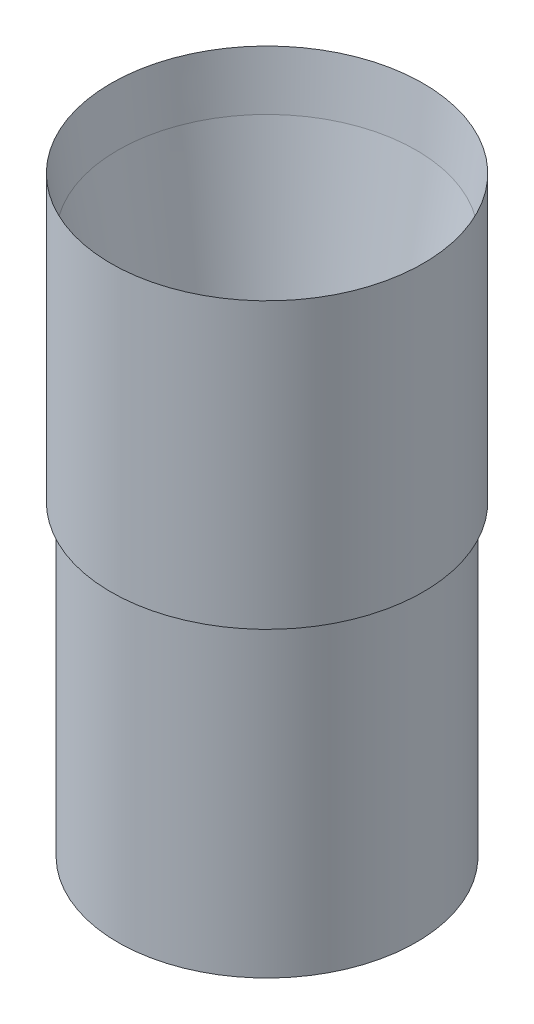
ISO-10303-21;
HEADER;
FILE_DESCRIPTION(('STEP AP214'),'2;1');
FILE_NAME('part.step','',(''),(''),'','','');
FILE_SCHEMA(('AUTOMOTIVE_DESIGN { 1 0 10303 214 1 1 1 1 }'));
ENDSEC;
DATA;
#1=APPLICATION_CONTEXT('core data for automotive mechanical design processes');
#2=APPLICATION_PROTOCOL_DEFINITION('international standard','automotive_design',2000,#1);
#3=PRODUCT_CONTEXT('',#1,'mechanical');
#4=PRODUCT('Part','Part','',(#3));
#5=PRODUCT_RELATED_PRODUCT_CATEGORY('part','',(#4));
#6=PRODUCT_DEFINITION_FORMATION('','',#4);
#7=PRODUCT_DEFINITION_CONTEXT('part definition',#1,'design');
#8=PRODUCT_DEFINITION('design','',#6,#7);
#9=PRODUCT_DEFINITION_SHAPE('','',#8);
#10=(LENGTH_UNIT() NAMED_UNIT(*) SI_UNIT(.MILLI.,.METRE.));
#11=(NAMED_UNIT(*) PLANE_ANGLE_UNIT() SI_UNIT($,.RADIAN.));
#12=(NAMED_UNIT(*) SI_UNIT($,.STERADIAN.) SOLID_ANGLE_UNIT());
#13=UNCERTAINTY_MEASURE_WITH_UNIT(LENGTH_MEASURE(1.E-05),#10,'distance_accuracy_value','');
#14=(GEOMETRIC_REPRESENTATION_CONTEXT(3) GLOBAL_UNCERTAINTY_ASSIGNED_CONTEXT((#13)) GLOBAL_UNIT_ASSIGNED_CONTEXT((#10,
#11,#12)) REPRESENTATION_CONTEXT('',''));
#15=CARTESIAN_POINT('',(0.,0.,0.));
#16=DIRECTION('',(0.,0.,1.));
#17=DIRECTION('',(1.,0.,0.));
#18=AXIS2_PLACEMENT_3D('',#15,#16,#17);
#19=CARTESIAN_POINT('',(49.3903,245.641517485021,0.));
#20=DIRECTION('',(0.,1.,0.));
#21=DIRECTION('',(-1.,0.,0.));
#22=AXIS2_PLACEMENT_3D('',#19,#20,#21);
#23=CYLINDRICAL_SURFACE('',#22,49.3903);
#24=CARTESIAN_POINT('',(49.3903,0.,0.));
#25=DIRECTION('',(0.,1.,0.));
#26=DIRECTION('',(-1.,0.,0.));
#27=AXIS2_PLACEMENT_3D('',#24,#25,#26);
#28=CIRCLE('',#27,49.3903);
#29=CARTESIAN_POINT('',(0.,0.,0.));
#30=VERTEX_POINT('',#29);
#31=EDGE_CURVE('E80',#30,#30,#28,.T.);
#32=ORIENTED_EDGE('',*,*,#31,.T.);
#33=EDGE_LOOP('',(#32));
#34=FACE_BOUND('',#33,.T.);
#35=CARTESIAN_POINT('',(49.3903,101.6,0.));
#36=DIRECTION('',(0.,1.,0.));
#37=DIRECTION('',(-1.,0.,0.));
#38=AXIS2_PLACEMENT_3D('',#35,#36,#37);
#39=CIRCLE('',#38,49.3903);
#40=CARTESIAN_POINT('',(0.,101.6,0.));
#41=VERTEX_POINT('',#40);
#42=EDGE_CURVE('E10',#41,#41,#39,.T.);
#43=ORIENTED_EDGE('',*,*,#42,.F.);
#44=EDGE_LOOP('',(#43));
#45=FACE_BOUND('',#44,.T.);
#46=ADVANCED_FACE('F41',(#34,#45),#23,.T.);
#47=CARTESIAN_POINT('',(-2.286,101.6,0.));
#48=DIRECTION('',(0.,-1.,0.));
#49=DIRECTION('',(1.,0.,0.));
#50=AXIS2_PLACEMENT_3D('',#47,#48,#49);
#51=PLANE('',#50);
#52=ORIENTED_EDGE('',*,*,#42,.T.);
#53=EDGE_LOOP('',(#52));
#54=FACE_BOUND('',#53,.T.);
#55=CARTESIAN_POINT('',(49.3903,101.6,0.));
#56=DIRECTION('',(0.,1.,0.));
#57=DIRECTION('',(-1.,0.,0.));
#58=AXIS2_PLACEMENT_3D('',#55,#56,#57);
#59=CIRCLE('',#58,51.6763);
#60=CARTESIAN_POINT('',(-2.286,101.6,0.));
#61=VERTEX_POINT('',#60);
#62=EDGE_CURVE('E48',#61,#61,#59,.T.);
#63=ORIENTED_EDGE('',*,*,#62,.F.);
#64=EDGE_LOOP('',(#63));
#65=FACE_BOUND('',#64,.T.);
#66=ADVANCED_FACE('F99',(#54,#65),#51,.T.);
#67=CARTESIAN_POINT('',(49.3903,245.641517485021,0.));
#68=DIRECTION('',(0.,1.,0.));
#69=DIRECTION('',(-1.,0.,0.));
#70=AXIS2_PLACEMENT_3D('',#67,#68,#69);
#71=CYLINDRICAL_SURFACE('',#70,51.6763);
#72=ORIENTED_EDGE('',*,*,#62,.T.);
#73=EDGE_LOOP('',(#72));
#74=FACE_BOUND('',#73,.T.);
#75=CARTESIAN_POINT('',(49.3903,195.80606,0.));
#76=DIRECTION('',(0.,1.,0.));
#77=DIRECTION('',(-1.,0.,0.));
#78=AXIS2_PLACEMENT_3D('',#75,#76,#77);
#79=CIRCLE('',#78,51.6763);
#80=CARTESIAN_POINT('',(-2.28600000000001,195.80606,0.));
#81=VERTEX_POINT('',#80);
#82=EDGE_CURVE('E53',#81,#81,#79,.T.);
#83=ORIENTED_EDGE('',*,*,#82,.F.);
#84=EDGE_LOOP('',(#83));
#85=FACE_BOUND('',#84,.T.);
#86=ADVANCED_FACE('F103',(#74,#85),#71,.T.);
#87=CARTESIAN_POINT('',(49.3903,177.8,0.));
#88=DIRECTION('',(0.,1.,0.));
#89=DIRECTION('',(-1.,0.,0.));
#90=AXIS2_PLACEMENT_3D('',#87,#88,#89);
#91=CONICAL_SURFACE('',#90,49.3903,0.126281674104015);
#92=ORIENTED_EDGE('',*,*,#82,.T.);
#93=EDGE_LOOP('',(#92));
#94=FACE_BOUND('',#93,.T.);
#95=CARTESIAN_POINT('',(49.3903,177.8,0.));
#96=DIRECTION('',(0.,1.,0.));
#97=DIRECTION('',(-1.,0.,0.));
#98=AXIS2_PLACEMENT_3D('',#95,#96,#97);
#99=CIRCLE('',#98,49.3903);
#100=CARTESIAN_POINT('',(0.,177.8,0.));
#101=VERTEX_POINT('',#100);
#102=EDGE_CURVE('E58',#101,#101,#99,.T.);
#103=ORIENTED_EDGE('',*,*,#102,.F.);
#104=EDGE_LOOP('',(#103));
#105=FACE_BOUND('',#104,.T.);
#106=ADVANCED_FACE('F107',(#94,#105),#91,.F.);
#107=CARTESIAN_POINT('',(49.3903,127.,0.));
#108=DIRECTION('',(0.,1.,0.));
#109=DIRECTION('',(-1.,0.,0.));
#110=AXIS2_PLACEMENT_3D('',#107,#108,#109);
#111=CONICAL_SURFACE('',#110,40.4328893800097,0.174532925199437);
#112=ORIENTED_EDGE('',*,*,#102,.T.);
#113=EDGE_LOOP('',(#112));
#114=FACE_BOUND('',#113,.T.);
#115=CARTESIAN_POINT('',(49.3903,127.,0.));
#116=DIRECTION('',(0.,1.,0.));
#117=DIRECTION('',(-1.,0.,0.));
#118=AXIS2_PLACEMENT_3D('',#115,#116,#117);
#119=CIRCLE('',#118,40.4328893800097);
#120=CARTESIAN_POINT('',(8.95741061999026,127.,0.));
#121=VERTEX_POINT('',#120);
#122=EDGE_CURVE('E64',#121,#121,#119,.T.);
#123=ORIENTED_EDGE('',*,*,#122,.F.);
#124=EDGE_LOOP('',(#123));
#125=FACE_BOUND('',#124,.T.);
#126=ADVANCED_FACE('F113',(#114,#125),#111,.F.);
#127=CARTESIAN_POINT('',(49.3903,245.641517485021,0.));
#128=DIRECTION('',(0.,1.,0.));
#129=DIRECTION('',(-1.,0.,0.));
#130=AXIS2_PLACEMENT_3D('',#127,#128,#129);
#131=CYLINDRICAL_SURFACE('',#130,40.4328893800097);
#132=ORIENTED_EDGE('',*,*,#122,.T.);
#133=EDGE_LOOP('',(#132));
#134=FACE_BOUND('',#133,.T.);
#135=CARTESIAN_POINT('',(49.3903,101.6,0.));
#136=DIRECTION('',(0.,1.,0.));
#137=DIRECTION('',(-1.,0.,0.));
#138=AXIS2_PLACEMENT_3D('',#135,#136,#137);
#139=CIRCLE('',#138,40.4328893800097);
#140=CARTESIAN_POINT('',(8.95741061999027,101.6,0.));
#141=VERTEX_POINT('',#140);
#142=EDGE_CURVE('E68',#141,#141,#139,.T.);
#143=ORIENTED_EDGE('',*,*,#142,.F.);
#144=EDGE_LOOP('',(#143));
#145=FACE_BOUND('',#144,.T.);
#146=ADVANCED_FACE('F117',(#134,#145),#131,.F.);
#147=CARTESIAN_POINT('',(8.95741061999027,101.6,0.));
#148=DIRECTION('',(0.,-1.,0.));
#149=DIRECTION('',(1.,0.,0.));
#150=AXIS2_PLACEMENT_3D('',#147,#148,#149);
#151=PLANE('',#150);
#152=ORIENTED_EDGE('',*,*,#142,.T.);
#153=EDGE_LOOP('',(#152));
#154=FACE_BOUND('',#153,.T.);
#155=CARTESIAN_POINT('',(49.3903,101.6,0.));
#156=DIRECTION('',(0.,1.,0.));
#157=DIRECTION('',(-1.,0.,0.));
#158=AXIS2_PLACEMENT_3D('',#155,#156,#157);
#159=CIRCLE('',#158,47.3583);
#160=CARTESIAN_POINT('',(2.03199999999999,101.6,0.));
#161=VERTEX_POINT('',#160);
#162=EDGE_CURVE('E72',#161,#161,#159,.T.);
#163=ORIENTED_EDGE('',*,*,#162,.F.);
#164=EDGE_LOOP('',(#163));
#165=FACE_BOUND('',#164,.T.);
#166=ADVANCED_FACE('F95',(#154,#165),#151,.T.);
#167=CARTESIAN_POINT('',(49.3903,245.641517485021,0.));
#168=DIRECTION('',(0.,1.,0.));
#169=DIRECTION('',(-1.,0.,0.));
#170=AXIS2_PLACEMENT_3D('',#167,#168,#169);
#171=CYLINDRICAL_SURFACE('',#170,47.3583);
#172=ORIENTED_EDGE('',*,*,#162,.T.);
#173=EDGE_LOOP('',(#172));
#174=FACE_BOUND('',#173,.T.);
#175=CARTESIAN_POINT('',(49.3903,0.,0.));
#176=DIRECTION('',(0.,1.,0.));
#177=DIRECTION('',(-1.,0.,0.));
#178=AXIS2_PLACEMENT_3D('',#175,#176,#177);
#179=CIRCLE('',#178,47.3583);
#180=CARTESIAN_POINT('',(2.032,0.,0.));
#181=VERTEX_POINT('',#180);
#182=EDGE_CURVE('E76',#181,#181,#179,.T.);
#183=ORIENTED_EDGE('',*,*,#182,.F.);
#184=EDGE_LOOP('',(#183));
#185=FACE_BOUND('',#184,.T.);
#186=ADVANCED_FACE('F89',(#174,#185),#171,.F.);
#187=CARTESIAN_POINT('',(2.032,0.,0.));
#188=DIRECTION('',(0.,-1.,0.));
#189=DIRECTION('',(1.,0.,0.));
#190=AXIS2_PLACEMENT_3D('',#187,#188,#189);
#191=PLANE('',#190);
#192=ORIENTED_EDGE('',*,*,#182,.T.);
#193=EDGE_LOOP('',(#192));
#194=FACE_BOUND('',#193,.T.);
#195=ORIENTED_EDGE('',*,*,#31,.F.);
#196=EDGE_LOOP('',(#195));
#197=FACE_BOUND('',#196,.T.);
#198=ADVANCED_FACE('F87',(#194,#197),#191,.T.);
#199=CLOSED_SHELL('',(#46,#66,#86,#106,#126,#146,#166,#186,#198));
#200=MANIFOLD_SOLID_BREP('B2',#199);
#201=ADVANCED_BREP_SHAPE_REPRESENTATION('',(#18,#200),#14);
#202=SHAPE_DEFINITION_REPRESENTATION(#9,#201);
ENDSEC;
END-ISO-10303-21;
